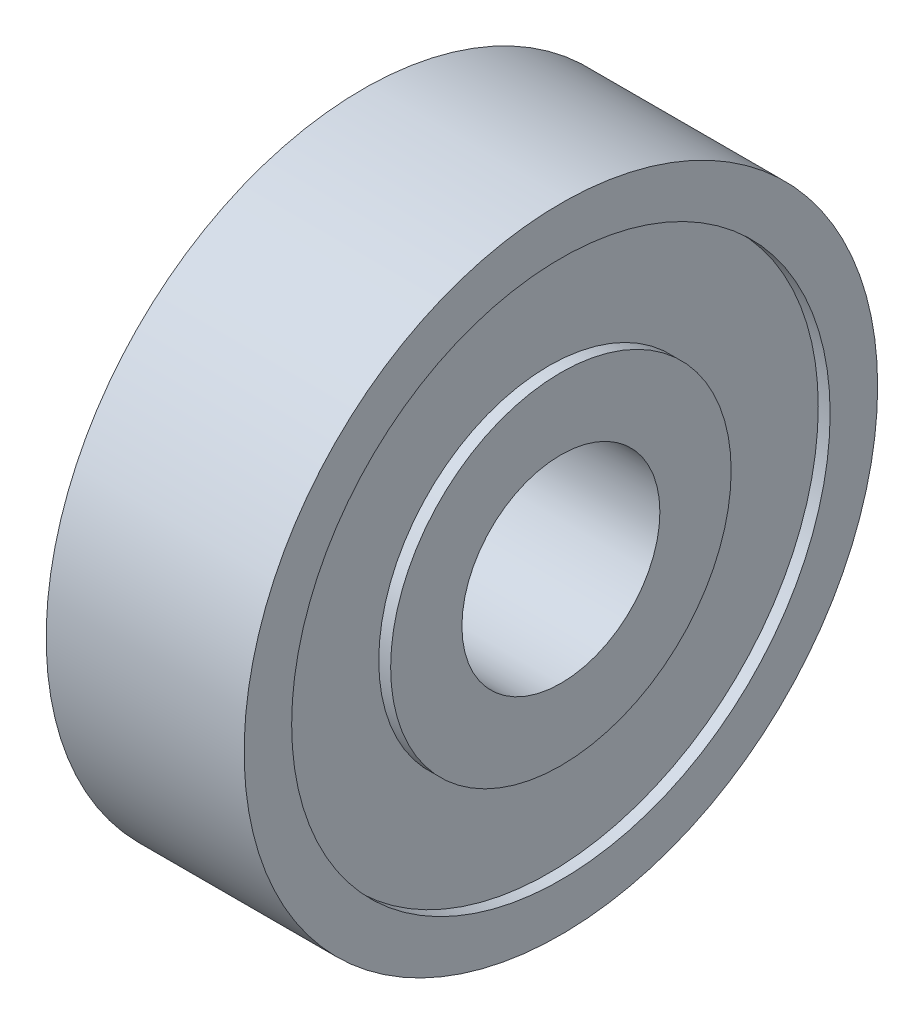
ISO-10303-21;
HEADER;
FILE_DESCRIPTION(('STEP AP214'),'2;1');
FILE_NAME('part.step','',(''),(''),'','','');
FILE_SCHEMA(('AUTOMOTIVE_DESIGN { 1 0 10303 214 1 1 1 1 }'));
ENDSEC;
DATA;
#1=APPLICATION_CONTEXT('core data for automotive mechanical design processes');
#2=APPLICATION_PROTOCOL_DEFINITION('international standard','automotive_design',2000,#1);
#3=PRODUCT_CONTEXT('',#1,'mechanical');
#4=PRODUCT('Part','Part','',(#3));
#5=PRODUCT_RELATED_PRODUCT_CATEGORY('part','',(#4));
#6=PRODUCT_DEFINITION_FORMATION('','',#4);
#7=PRODUCT_DEFINITION_CONTEXT('part definition',#1,'design');
#8=PRODUCT_DEFINITION('design','',#6,#7);
#9=PRODUCT_DEFINITION_SHAPE('','',#8);
#10=(LENGTH_UNIT() NAMED_UNIT(*) SI_UNIT(.MILLI.,.METRE.));
#11=(NAMED_UNIT(*) PLANE_ANGLE_UNIT() SI_UNIT($,.RADIAN.));
#12=(NAMED_UNIT(*) SI_UNIT($,.STERADIAN.) SOLID_ANGLE_UNIT());
#13=UNCERTAINTY_MEASURE_WITH_UNIT(LENGTH_MEASURE(1.E-05),#10,'distance_accuracy_value','');
#14=(GEOMETRIC_REPRESENTATION_CONTEXT(3) GLOBAL_UNCERTAINTY_ASSIGNED_CONTEXT((#13)) GLOBAL_UNIT_ASSIGNED_CONTEXT((#10,
#11,#12)) REPRESENTATION_CONTEXT('',''));
#15=CARTESIAN_POINT('',(0.,0.,0.));
#16=DIRECTION('',(0.,0.,1.));
#17=DIRECTION('',(1.,0.,0.));
#18=AXIS2_PLACEMENT_3D('',#15,#16,#17);
#19=CARTESIAN_POINT('',(-2.5,2.5,-1.52655665885959E-13));
#20=DIRECTION('',(-1.,0.,0.));
#21=DIRECTION('',(0.,0.,1.00000000000001));
#22=AXIS2_PLACEMENT_3D('',#19,#20,#21);
#23=PLANE('',#22);
#24=CARTESIAN_POINT('',(-2.5,0.,0.));
#25=DIRECTION('',(1.,0.,0.));
#26=DIRECTION('',(0.,0.,-1.00000000000001));
#27=AXIS2_PLACEMENT_3D('',#24,#25,#26);
#28=CIRCLE('',#27,2.5);
#29=CARTESIAN_POINT('',(-2.5,0.,-2.50000000000001));
#30=VERTEX_POINT('',#29);
#31=EDGE_CURVE('E74',#30,#30,#28,.T.);
#32=ORIENTED_EDGE('',*,*,#31,.T.);
#33=EDGE_LOOP('',(#32));
#34=FACE_BOUND('',#33,.T.);
#35=CARTESIAN_POINT('',(-2.5,0.,0.));
#36=DIRECTION('',(1.,0.,0.));
#37=DIRECTION('',(0.,0.,-1.00000000000001));
#38=AXIS2_PLACEMENT_3D('',#35,#36,#37);
#39=CIRCLE('',#38,4.3);
#40=CARTESIAN_POINT('',(-2.5,0.,-4.30000000000002));
#41=VERTEX_POINT('',#40);
#42=EDGE_CURVE('E10',#41,#41,#39,.T.);
#43=ORIENTED_EDGE('',*,*,#42,.F.);
#44=EDGE_LOOP('',(#43));
#45=FACE_BOUND('',#44,.T.);
#46=ADVANCED_FACE('F34',(#34,#45),#23,.T.);
#47=CARTESIAN_POINT('',(0.,0.,0.));
#48=DIRECTION('',(1.,0.,0.));
#49=DIRECTION('',(0.,0.,-1.00000000000001));
#50=AXIS2_PLACEMENT_3D('',#47,#48,#49);
#51=CYLINDRICAL_SURFACE('',#50,4.3);
#52=ORIENTED_EDGE('',*,*,#42,.T.);
#53=EDGE_LOOP('',(#52));
#54=FACE_BOUND('',#53,.T.);
#55=CARTESIAN_POINT('',(-2.19999999999998,0.,0.));
#56=DIRECTION('',(1.,0.,0.));
#57=DIRECTION('',(0.,0.,-1.00000000000001));
#58=AXIS2_PLACEMENT_3D('',#55,#56,#57);
#59=CIRCLE('',#58,4.3);
#60=CARTESIAN_POINT('',(-2.19999999999998,0.,-4.30000000000002));
#61=VERTEX_POINT('',#60);
#62=EDGE_CURVE('E40',#61,#61,#59,.T.);
#63=ORIENTED_EDGE('',*,*,#62,.F.);
#64=EDGE_LOOP('',(#63));
#65=FACE_BOUND('',#64,.T.);
#66=ADVANCED_FACE('F92',(#54,#65),#51,.T.);
#67=CARTESIAN_POINT('',(-2.19999999999998,4.30000000000012,-1.52655665885959E-13));
#68=DIRECTION('',(-1.,0.,0.));
#69=DIRECTION('',(0.,0.,1.00000000000001));
#70=AXIS2_PLACEMENT_3D('',#67,#68,#69);
#71=PLANE('',#70);
#72=ORIENTED_EDGE('',*,*,#62,.T.);
#73=EDGE_LOOP('',(#72));
#74=FACE_BOUND('',#73,.T.);
#75=CARTESIAN_POINT('',(-2.19999999999998,0.,0.));
#76=DIRECTION('',(1.,0.,0.));
#77=DIRECTION('',(0.,0.,-1.00000000000001));
#78=AXIS2_PLACEMENT_3D('',#75,#76,#77);
#79=CIRCLE('',#78,6.8);
#80=CARTESIAN_POINT('',(-2.19999999999998,0.,-6.80000000000004));
#81=VERTEX_POINT('',#80);
#82=EDGE_CURVE('E44',#81,#81,#79,.T.);
#83=ORIENTED_EDGE('',*,*,#82,.F.);
#84=EDGE_LOOP('',(#83));
#85=FACE_BOUND('',#84,.T.);
#86=ADVANCED_FACE('F96',(#74,#85),#71,.T.);
#87=CARTESIAN_POINT('',(0.,0.,0.));
#88=DIRECTION('',(1.,0.,0.));
#89=DIRECTION('',(0.,0.,-1.00000000000001));
#90=AXIS2_PLACEMENT_3D('',#87,#88,#89);
#91=CYLINDRICAL_SURFACE('',#90,6.8);
#92=ORIENTED_EDGE('',*,*,#82,.T.);
#93=EDGE_LOOP('',(#92));
#94=FACE_BOUND('',#93,.T.);
#95=CARTESIAN_POINT('',(-2.5,0.,0.));
#96=DIRECTION('',(1.,0.,0.));
#97=DIRECTION('',(0.,0.,-1.00000000000001));
#98=AXIS2_PLACEMENT_3D('',#95,#96,#97);
#99=CIRCLE('',#98,6.8);
#100=CARTESIAN_POINT('',(-2.5,0.,-6.80000000000004));
#101=VERTEX_POINT('',#100);
#102=EDGE_CURVE('E48',#101,#101,#99,.T.);
#103=ORIENTED_EDGE('',*,*,#102,.F.);
#104=EDGE_LOOP('',(#103));
#105=FACE_BOUND('',#104,.T.);
#106=ADVANCED_FACE('F100',(#94,#105),#91,.F.);
#107=CARTESIAN_POINT('',(-2.5,6.79999999999988,0.));
#108=DIRECTION('',(-1.,0.,0.));
#109=DIRECTION('',(0.,0.,1.00000000000001));
#110=AXIS2_PLACEMENT_3D('',#107,#108,#109);
#111=PLANE('',#110);
#112=ORIENTED_EDGE('',*,*,#102,.T.);
#113=EDGE_LOOP('',(#112));
#114=FACE_BOUND('',#113,.T.);
#115=CARTESIAN_POINT('',(-2.5,0.,0.));
#116=DIRECTION('',(1.,0.,0.));
#117=DIRECTION('',(0.,0.,-1.00000000000001));
#118=AXIS2_PLACEMENT_3D('',#115,#116,#117);
#119=CIRCLE('',#118,8.);
#120=CARTESIAN_POINT('',(-2.5,0.,-8.00000000000004));
#121=VERTEX_POINT('',#120);
#122=EDGE_CURVE('E53',#121,#121,#119,.T.);
#123=ORIENTED_EDGE('',*,*,#122,.F.);
#124=EDGE_LOOP('',(#123));
#125=FACE_BOUND('',#124,.T.);
#126=ADVANCED_FACE('F106',(#114,#125),#111,.T.);
#127=CARTESIAN_POINT('',(0.,0.,0.));
#128=DIRECTION('',(1.,0.,0.));
#129=DIRECTION('',(0.,0.,-1.00000000000001));
#130=AXIS2_PLACEMENT_3D('',#127,#128,#129);
#131=CYLINDRICAL_SURFACE('',#130,8.);
#132=ORIENTED_EDGE('',*,*,#122,.T.);
#133=EDGE_LOOP('',(#132));
#134=FACE_BOUND('',#133,.T.);
#135=CARTESIAN_POINT('',(2.5,0.,0.));
#136=DIRECTION('',(1.,0.,0.));
#137=DIRECTION('',(0.,0.,-1.00000000000001));
#138=AXIS2_PLACEMENT_3D('',#135,#136,#137);
#139=CIRCLE('',#138,8.);
#140=CARTESIAN_POINT('',(2.5,0.,-8.00000000000004));
#141=VERTEX_POINT('',#140);
#142=EDGE_CURVE('E56',#141,#141,#139,.T.);
#143=ORIENTED_EDGE('',*,*,#142,.F.);
#144=EDGE_LOOP('',(#143));
#145=FACE_BOUND('',#144,.T.);
#146=ADVANCED_FACE('F110',(#134,#145),#131,.T.);
#147=CARTESIAN_POINT('',(2.5,6.79999999999988,0.));
#148=DIRECTION('',(1.,0.,0.));
#149=DIRECTION('',(0.,0.,-1.00000000000001));
#150=AXIS2_PLACEMENT_3D('',#147,#148,#149);
#151=PLANE('',#150);
#152=ORIENTED_EDGE('',*,*,#142,.T.);
#153=EDGE_LOOP('',(#152));
#154=FACE_BOUND('',#153,.T.);
#155=CARTESIAN_POINT('',(2.5,0.,0.));
#156=DIRECTION('',(1.,0.,0.));
#157=DIRECTION('',(0.,0.,-1.00000000000001));
#158=AXIS2_PLACEMENT_3D('',#155,#156,#157);
#159=CIRCLE('',#158,6.8);
#160=CARTESIAN_POINT('',(2.5,0.,-6.80000000000004));
#161=VERTEX_POINT('',#160);
#162=EDGE_CURVE('E59',#161,#161,#159,.T.);
#163=ORIENTED_EDGE('',*,*,#162,.F.);
#164=EDGE_LOOP('',(#163));
#165=FACE_BOUND('',#164,.T.);
#166=ADVANCED_FACE('F114',(#154,#165),#151,.T.);
#167=CARTESIAN_POINT('',(0.,0.,0.));
#168=DIRECTION('',(1.,0.,0.));
#169=DIRECTION('',(0.,0.,-1.00000000000001));
#170=AXIS2_PLACEMENT_3D('',#167,#168,#169);
#171=CYLINDRICAL_SURFACE('',#170,6.8);
#172=ORIENTED_EDGE('',*,*,#162,.T.);
#173=EDGE_LOOP('',(#172));
#174=FACE_BOUND('',#173,.T.);
#175=CARTESIAN_POINT('',(2.19999999999998,0.,0.));
#176=DIRECTION('',(1.,0.,0.));
#177=DIRECTION('',(0.,0.,-1.00000000000001));
#178=AXIS2_PLACEMENT_3D('',#175,#176,#177);
#179=CIRCLE('',#178,6.8);
#180=CARTESIAN_POINT('',(2.19999999999998,0.,-6.80000000000004));
#181=VERTEX_POINT('',#180);
#182=EDGE_CURVE('E62',#181,#181,#179,.T.);
#183=ORIENTED_EDGE('',*,*,#182,.F.);
#184=EDGE_LOOP('',(#183));
#185=FACE_BOUND('',#184,.T.);
#186=ADVANCED_FACE('F118',(#174,#185),#171,.F.);
#187=CARTESIAN_POINT('',(2.19999999999998,4.30000000000012,-1.52655665885959E-13));
#188=DIRECTION('',(1.,0.,0.));
#189=DIRECTION('',(0.,0.,-1.00000000000001));
#190=AXIS2_PLACEMENT_3D('',#187,#188,#189);
#191=PLANE('',#190);
#192=ORIENTED_EDGE('',*,*,#182,.T.);
#193=EDGE_LOOP('',(#192));
#194=FACE_BOUND('',#193,.T.);
#195=CARTESIAN_POINT('',(2.19999999999998,0.,0.));
#196=DIRECTION('',(1.,0.,0.));
#197=DIRECTION('',(0.,0.,-1.00000000000001));
#198=AXIS2_PLACEMENT_3D('',#195,#196,#197);
#199=CIRCLE('',#198,4.3);
#200=CARTESIAN_POINT('',(2.19999999999998,0.,-4.30000000000002));
#201=VERTEX_POINT('',#200);
#202=EDGE_CURVE('E65',#201,#201,#199,.T.);
#203=ORIENTED_EDGE('',*,*,#202,.F.);
#204=EDGE_LOOP('',(#203));
#205=FACE_BOUND('',#204,.T.);
#206=ADVANCED_FACE('F122',(#194,#205),#191,.T.);
#207=CARTESIAN_POINT('',(0.,0.,0.));
#208=DIRECTION('',(1.,0.,0.));
#209=DIRECTION('',(0.,0.,-1.00000000000001));
#210=AXIS2_PLACEMENT_3D('',#207,#208,#209);
#211=CYLINDRICAL_SURFACE('',#210,4.3);
#212=ORIENTED_EDGE('',*,*,#202,.T.);
#213=EDGE_LOOP('',(#212));
#214=FACE_BOUND('',#213,.T.);
#215=CARTESIAN_POINT('',(2.5,0.,0.));
#216=DIRECTION('',(1.,0.,0.));
#217=DIRECTION('',(0.,0.,-1.00000000000001));
#218=AXIS2_PLACEMENT_3D('',#215,#216,#217);
#219=CIRCLE('',#218,4.3);
#220=CARTESIAN_POINT('',(2.5,0.,-4.30000000000002));
#221=VERTEX_POINT('',#220);
#222=EDGE_CURVE('E68',#221,#221,#219,.T.);
#223=ORIENTED_EDGE('',*,*,#222,.F.);
#224=EDGE_LOOP('',(#223));
#225=FACE_BOUND('',#224,.T.);
#226=ADVANCED_FACE('F88',(#214,#225),#211,.T.);
#227=CARTESIAN_POINT('',(2.5,2.5,-1.52655665885959E-13));
#228=DIRECTION('',(1.,0.,0.));
#229=DIRECTION('',(0.,0.,-1.00000000000001));
#230=AXIS2_PLACEMENT_3D('',#227,#228,#229);
#231=PLANE('',#230);
#232=ORIENTED_EDGE('',*,*,#222,.T.);
#233=EDGE_LOOP('',(#232));
#234=FACE_BOUND('',#233,.T.);
#235=CARTESIAN_POINT('',(2.5,0.,0.));
#236=DIRECTION('',(1.,0.,0.));
#237=DIRECTION('',(0.,0.,-1.00000000000001));
#238=AXIS2_PLACEMENT_3D('',#235,#236,#237);
#239=CIRCLE('',#238,2.5);
#240=CARTESIAN_POINT('',(2.5,0.,-2.50000000000001));
#241=VERTEX_POINT('',#240);
#242=EDGE_CURVE('E71',#241,#241,#239,.T.);
#243=ORIENTED_EDGE('',*,*,#242,.F.);
#244=EDGE_LOOP('',(#243));
#245=FACE_BOUND('',#244,.T.);
#246=ADVANCED_FACE('F82',(#234,#245),#231,.T.);
#247=CARTESIAN_POINT('',(0.,0.,0.));
#248=DIRECTION('',(1.,0.,0.));
#249=DIRECTION('',(0.,0.,-1.00000000000001));
#250=AXIS2_PLACEMENT_3D('',#247,#248,#249);
#251=CYLINDRICAL_SURFACE('',#250,2.5);
#252=ORIENTED_EDGE('',*,*,#242,.T.);
#253=EDGE_LOOP('',(#252));
#254=FACE_BOUND('',#253,.T.);
#255=ORIENTED_EDGE('',*,*,#31,.F.);
#256=EDGE_LOOP('',(#255));
#257=FACE_BOUND('',#256,.T.);
#258=ADVANCED_FACE('F80',(#254,#257),#251,.F.);
#259=CLOSED_SHELL('',(#46,#66,#86,#106,#126,#146,#166,#186,#206,#226,#246,#258));
#260=MANIFOLD_SOLID_BREP('B2',#259);
#261=ADVANCED_BREP_SHAPE_REPRESENTATION('',(#18,#260),#14);
#262=SHAPE_DEFINITION_REPRESENTATION(#9,#261);
ENDSEC;
END-ISO-10303-21;
